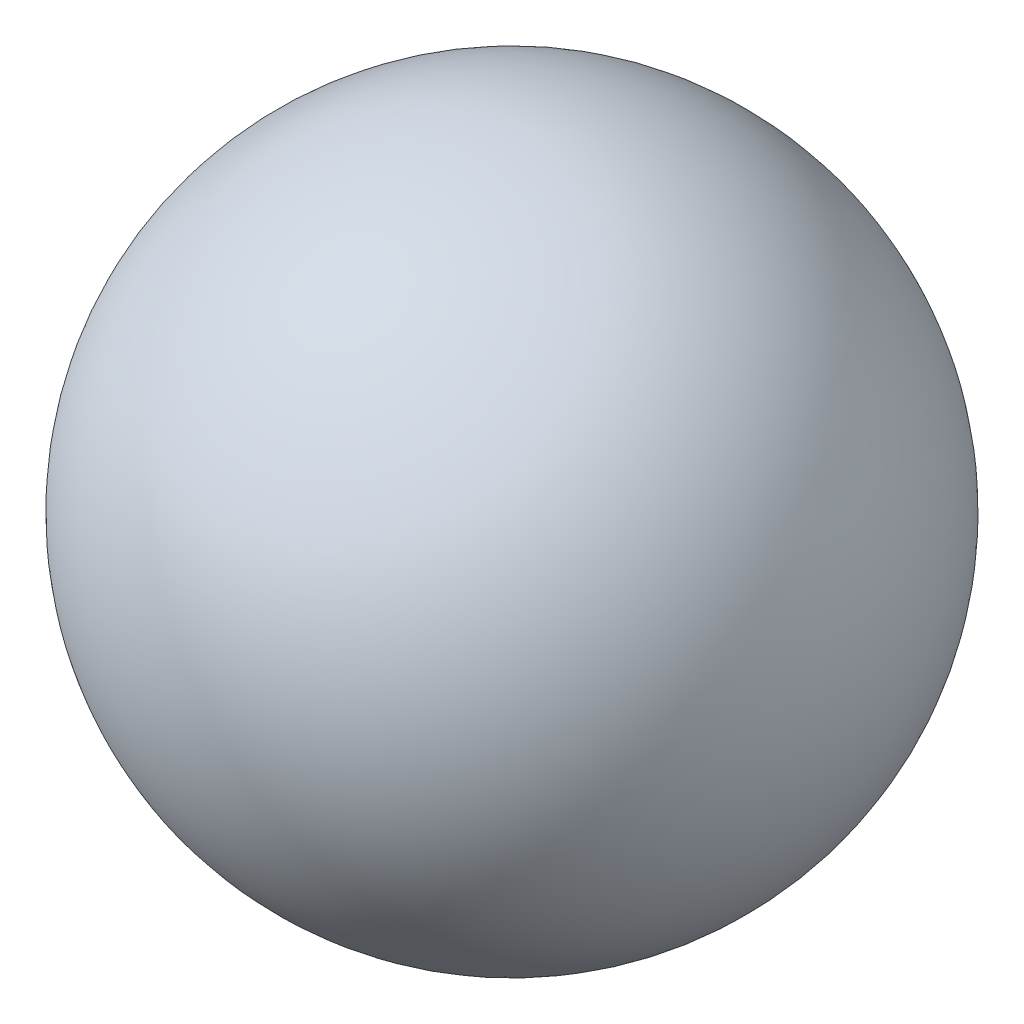
ISO-10303-21;
HEADER;
FILE_DESCRIPTION(('STEP AP214'),'2;1');
FILE_NAME('part.step','',(''),(''),'','','');
FILE_SCHEMA(('AUTOMOTIVE_DESIGN { 1 0 10303 214 1 1 1 1 }'));
ENDSEC;
DATA;
#1=APPLICATION_CONTEXT('core data for automotive mechanical design processes');
#2=APPLICATION_PROTOCOL_DEFINITION('international standard','automotive_design',2000,#1);
#3=PRODUCT_CONTEXT('',#1,'mechanical');
#4=PRODUCT('Part','Part','',(#3));
#5=PRODUCT_RELATED_PRODUCT_CATEGORY('part','',(#4));
#6=PRODUCT_DEFINITION_FORMATION('','',#4);
#7=PRODUCT_DEFINITION_CONTEXT('part definition',#1,'design');
#8=PRODUCT_DEFINITION('design','',#6,#7);
#9=PRODUCT_DEFINITION_SHAPE('','',#8);
#10=(LENGTH_UNIT() NAMED_UNIT(*) SI_UNIT(.MILLI.,.METRE.));
#11=(NAMED_UNIT(*) PLANE_ANGLE_UNIT() SI_UNIT($,.RADIAN.));
#12=(NAMED_UNIT(*) SI_UNIT($,.STERADIAN.) SOLID_ANGLE_UNIT());
#13=UNCERTAINTY_MEASURE_WITH_UNIT(LENGTH_MEASURE(1.E-05),#10,'distance_accuracy_value','');
#14=(GEOMETRIC_REPRESENTATION_CONTEXT(3) GLOBAL_UNCERTAINTY_ASSIGNED_CONTEXT((#13)) GLOBAL_UNIT_ASSIGNED_CONTEXT((#10,
#11,#12)) REPRESENTATION_CONTEXT('',''));
#15=CARTESIAN_POINT('',(0.,0.,0.));
#16=DIRECTION('',(0.,0.,1.));
#17=DIRECTION('',(1.,0.,0.));
#18=AXIS2_PLACEMENT_3D('',#15,#16,#17);
#19=CARTESIAN_POINT('',(-201.335185185185,0.,-76.2536412332065));
#20=DIRECTION('',(0.,0.,-1.));
#21=DIRECTION('',(1.,0.,0.));
#22=AXIS2_PLACEMENT_3D('',#19,#20,#21);
#23=SPHERICAL_SURFACE('',#22,33.35);
#24=CARTESIAN_POINT('',(-201.335185185185,0.,-109.603641233207));
#25=VERTEX_POINT('',#24);
#26=VERTEX_LOOP('',#25);
#27=FACE_BOUND('',#26,.T.);
#28=ADVANCED_FACE('F30',(#27),#23,.T.);
#29=CLOSED_SHELL('',(#28));
#30=MANIFOLD_SOLID_BREP('B2',#29);
#31=ADVANCED_BREP_SHAPE_REPRESENTATION('',(#18,#30),#14);
#32=SHAPE_DEFINITION_REPRESENTATION(#9,#31);
ENDSEC;
END-ISO-10303-21;
